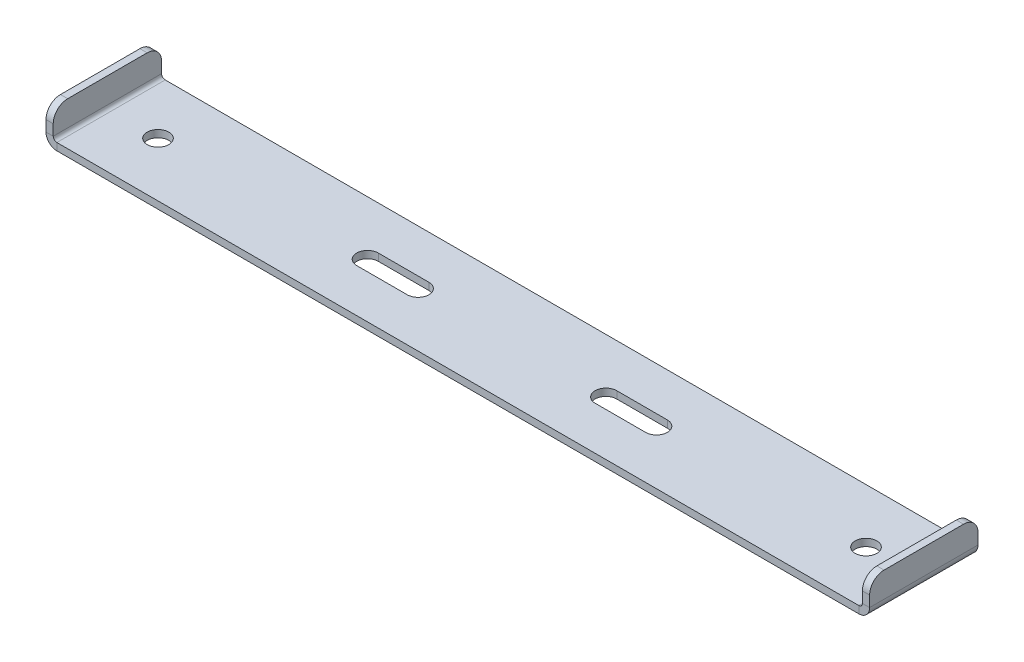
ISO-10303-21;
HEADER;
FILE_DESCRIPTION(('STEP AP214'),'2;1');
FILE_NAME('part.step','',(''),(''),'','','');
FILE_SCHEMA(('AUTOMOTIVE_DESIGN { 1 0 10303 214 1 1 1 1 }'));
ENDSEC;
DATA;
#1=APPLICATION_CONTEXT('core data for automotive mechanical design processes');
#2=APPLICATION_PROTOCOL_DEFINITION('international standard','automotive_design',2000,#1);
#3=PRODUCT_CONTEXT('',#1,'mechanical');
#4=PRODUCT('Part','Part','',(#3));
#5=PRODUCT_RELATED_PRODUCT_CATEGORY('part','',(#4));
#6=PRODUCT_DEFINITION_FORMATION('','',#4);
#7=PRODUCT_DEFINITION_CONTEXT('part definition',#1,'design');
#8=PRODUCT_DEFINITION('design','',#6,#7);
#9=PRODUCT_DEFINITION_SHAPE('','',#8);
#10=(LENGTH_UNIT() NAMED_UNIT(*) SI_UNIT(.MILLI.,.METRE.));
#11=(NAMED_UNIT(*) PLANE_ANGLE_UNIT() SI_UNIT($,.RADIAN.));
#12=(NAMED_UNIT(*) SI_UNIT($,.STERADIAN.) SOLID_ANGLE_UNIT());
#13=UNCERTAINTY_MEASURE_WITH_UNIT(LENGTH_MEASURE(1.E-05),#10,'distance_accuracy_value','');
#14=(GEOMETRIC_REPRESENTATION_CONTEXT(3) GLOBAL_UNCERTAINTY_ASSIGNED_CONTEXT((#13)) GLOBAL_UNIT_ASSIGNED_CONTEXT((#10,
#11,#12)) REPRESENTATION_CONTEXT('',''));
#15=CARTESIAN_POINT('',(0.,0.,0.));
#16=DIRECTION('',(0.,0.,1.));
#17=DIRECTION('',(1.,0.,0.));
#18=AXIS2_PLACEMENT_3D('',#15,#16,#17);
#19=CARTESIAN_POINT('',(0.,1.,0.));
#20=DIRECTION('',(0.,1.,0.));
#21=DIRECTION('',(0.,0.,1.));
#22=AXIS2_PLACEMENT_3D('',#19,#20,#21);
#23=PLANE('',#22);
#24=CARTESIAN_POINT('',(49.,1.,0.));
#25=DIRECTION('',(0.,1.,0.));
#26=DIRECTION('',(0.,0.,-1.));
#27=AXIS2_PLACEMENT_3D('',#24,#25,#26);
#28=CIRCLE('',#27,1.49999999999999);
#29=CARTESIAN_POINT('',(49.,1.,-1.5));
#30=VERTEX_POINT('',#29);
#31=EDGE_CURVE('E433',#30,#30,#28,.T.);
#32=ORIENTED_EDGE('',*,*,#31,.F.);
#33=EDGE_LOOP('',(#32));
#34=FACE_BOUND('',#33,.T.);
#35=CARTESIAN_POINT('',(-49.,1.,0.));
#36=DIRECTION('',(0.,1.,0.));
#37=DIRECTION('',(0.,0.,1.));
#38=AXIS2_PLACEMENT_3D('',#35,#36,#37);
#39=CIRCLE('',#38,1.5);
#40=CARTESIAN_POINT('',(-49.,1.,1.49999999999999));
#41=VERTEX_POINT('',#40);
#42=EDGE_CURVE('E273',#41,#41,#39,.T.);
#43=ORIENTED_EDGE('',*,*,#42,.F.);
#44=EDGE_LOOP('',(#43));
#45=FACE_BOUND('',#44,.T.);
#46=CARTESIAN_POINT('',(20.,1.,0.));
#47=DIRECTION('',(0.,1.,0.));
#48=DIRECTION('',(0.,0.,-1.));
#49=AXIS2_PLACEMENT_3D('',#46,#47,#48);
#50=CIRCLE('',#49,1.5);
#51=CARTESIAN_POINT('',(20.,1.,1.5));
#52=VERTEX_POINT('',#51);
#53=CARTESIAN_POINT('',(20.,1.,-1.5));
#54=VERTEX_POINT('',#53);
#55=EDGE_CURVE('E249',#52,#54,#50,.T.);
#56=ORIENTED_EDGE('',*,*,#55,.F.);
#57=DIRECTION('',(1.,0.,0.));
#58=VECTOR('',#57,1.);
#59=CARTESIAN_POINT('',(20.,1.,1.5));
#60=LINE('',#59,#58);
#61=CARTESIAN_POINT('',(13.,1.,1.5));
#62=VERTEX_POINT('',#61);
#63=EDGE_CURVE('E267',#62,#52,#60,.T.);
#64=ORIENTED_EDGE('',*,*,#63,.F.);
#65=CARTESIAN_POINT('',(13.,1.,0.));
#66=DIRECTION('',(0.,1.,0.));
#67=DIRECTION('',(0.,0.,-1.));
#68=AXIS2_PLACEMENT_3D('',#65,#66,#67);
#69=CIRCLE('',#68,1.5);
#70=CARTESIAN_POINT('',(13.,1.,-1.5));
#71=VERTEX_POINT('',#70);
#72=EDGE_CURVE('E270',#71,#62,#69,.T.);
#73=ORIENTED_EDGE('',*,*,#72,.F.);
#74=DIRECTION('',(-1.,0.,0.));
#75=VECTOR('',#74,1.);
#76=CARTESIAN_POINT('',(20.,1.,-1.5));
#77=LINE('',#76,#75);
#78=EDGE_CURVE('E279',#54,#71,#77,.T.);
#79=ORIENTED_EDGE('',*,*,#78,.F.);
#80=EDGE_LOOP('',(#56,#64,#73,#79));
#81=FACE_BOUND('',#80,.T.);
#82=CARTESIAN_POINT('',(-20.,1.,0.));
#83=DIRECTION('',(0.,1.,0.));
#84=DIRECTION('',(0.,0.,1.));
#85=AXIS2_PLACEMENT_3D('',#82,#83,#84);
#86=CIRCLE('',#85,1.5);
#87=CARTESIAN_POINT('',(-20.,1.,-1.5));
#88=VERTEX_POINT('',#87);
#89=CARTESIAN_POINT('',(-20.,1.,1.5));
#90=VERTEX_POINT('',#89);
#91=EDGE_CURVE('E286',#88,#90,#86,.T.);
#92=ORIENTED_EDGE('',*,*,#91,.F.);
#93=DIRECTION('',(-1.,0.,0.));
#94=VECTOR('',#93,1.);
#95=CARTESIAN_POINT('',(-20.,1.,-1.5));
#96=LINE('',#95,#94);
#97=CARTESIAN_POINT('',(-13.,1.,-1.5));
#98=VERTEX_POINT('',#97);
#99=EDGE_CURVE('E294',#98,#88,#96,.T.);
#100=ORIENTED_EDGE('',*,*,#99,.F.);
#101=CARTESIAN_POINT('',(-13.,1.,0.));
#102=DIRECTION('',(0.,1.,0.));
#103=DIRECTION('',(0.,0.,1.));
#104=AXIS2_PLACEMENT_3D('',#101,#102,#103);
#105=CIRCLE('',#104,1.5);
#106=CARTESIAN_POINT('',(-13.,1.,1.5));
#107=VERTEX_POINT('',#106);
#108=EDGE_CURVE('E308',#107,#98,#105,.T.);
#109=ORIENTED_EDGE('',*,*,#108,.F.);
#110=DIRECTION('',(1.,0.,0.));
#111=VECTOR('',#110,1.);
#112=CARTESIAN_POINT('',(-20.,1.,1.5));
#113=LINE('',#112,#111);
#114=EDGE_CURVE('E305',#90,#107,#113,.T.);
#115=ORIENTED_EDGE('',*,*,#114,.F.);
#116=EDGE_LOOP('',(#92,#100,#109,#115));
#117=FACE_BOUND('',#116,.T.);
#118=DIRECTION('',(-1.,0.,0.));
#119=VECTOR('',#118,1.);
#120=CARTESIAN_POINT('',(-57.,1.,-7.5));
#121=LINE('',#120,#119);
#122=CARTESIAN_POINT('',(55.5,1.,-7.5));
#123=VERTEX_POINT('',#122);
#124=CARTESIAN_POINT('',(-55.5,1.,-7.5));
#125=VERTEX_POINT('',#124);
#126=EDGE_CURVE('E418',#123,#125,#121,.T.);
#127=ORIENTED_EDGE('',*,*,#126,.T.);
#128=DIRECTION('',(0.,0.,1.));
#129=VECTOR('',#128,1.);
#130=CARTESIAN_POINT('',(-55.5,1.,7.5));
#131=LINE('',#130,#129);
#132=CARTESIAN_POINT('',(-55.5,1.,7.5));
#133=VERTEX_POINT('',#132);
#134=EDGE_CURVE('E357',#133,#125,#131,.F.);
#135=ORIENTED_EDGE('',*,*,#134,.F.);
#136=DIRECTION('',(1.,0.,0.));
#137=VECTOR('',#136,1.);
#138=CARTESIAN_POINT('',(-57.,1.,7.5));
#139=LINE('',#138,#137);
#140=CARTESIAN_POINT('',(55.5,1.,7.5));
#141=VERTEX_POINT('',#140);
#142=EDGE_CURVE('E421',#133,#141,#139,.T.);
#143=ORIENTED_EDGE('',*,*,#142,.T.);
#144=DIRECTION('',(0.,0.,-1.));
#145=VECTOR('',#144,1.);
#146=CARTESIAN_POINT('',(55.5,1.,-7.5));
#147=LINE('',#146,#145);
#148=EDGE_CURVE('E408',#123,#141,#147,.F.);
#149=ORIENTED_EDGE('',*,*,#148,.F.);
#150=EDGE_LOOP('',(#127,#135,#143,#149));
#151=FACE_BOUND('',#150,.T.);
#152=ADVANCED_FACE('F79',(#34,#45,#81,#117,#151),#23,.T.);
#153=CARTESIAN_POINT('',(0.,0.,0.));
#154=DIRECTION('',(0.,1.,0.));
#155=DIRECTION('',(0.,0.,1.));
#156=AXIS2_PLACEMENT_3D('',#153,#154,#155);
#157=PLANE('',#156);
#158=CARTESIAN_POINT('',(49.,0.,0.));
#159=DIRECTION('',(0.,1.,0.));
#160=DIRECTION('',(0.,0.,1.));
#161=AXIS2_PLACEMENT_3D('',#158,#159,#160);
#162=CIRCLE('',#161,1.49999999999999);
#163=CARTESIAN_POINT('',(49.,0.,1.49999999999998));
#164=VERTEX_POINT('',#163);
#165=EDGE_CURVE('E430',#164,#164,#162,.T.);
#166=ORIENTED_EDGE('',*,*,#165,.T.);
#167=EDGE_LOOP('',(#166));
#168=FACE_BOUND('',#167,.T.);
#169=CARTESIAN_POINT('',(-49.,0.,0.));
#170=DIRECTION('',(0.,1.,0.));
#171=DIRECTION('',(0.,0.,1.));
#172=AXIS2_PLACEMENT_3D('',#169,#170,#171);
#173=CIRCLE('',#172,1.5);
#174=CARTESIAN_POINT('',(-49.,0.,1.49999999999999));
#175=VERTEX_POINT('',#174);
#176=EDGE_CURVE('E280',#175,#175,#173,.T.);
#177=ORIENTED_EDGE('',*,*,#176,.T.);
#178=EDGE_LOOP('',(#177));
#179=FACE_BOUND('',#178,.T.);
#180=DIRECTION('',(1.,0.,0.));
#181=VECTOR('',#180,1.);
#182=CARTESIAN_POINT('',(20.,0.,1.5));
#183=LINE('',#182,#181);
#184=CARTESIAN_POINT('',(13.,0.,1.5));
#185=VERTEX_POINT('',#184);
#186=CARTESIAN_POINT('',(20.,0.,1.5));
#187=VERTEX_POINT('',#186);
#188=EDGE_CURVE('E254',#185,#187,#183,.T.);
#189=ORIENTED_EDGE('',*,*,#188,.T.);
#190=CARTESIAN_POINT('',(20.,0.,0.));
#191=DIRECTION('',(0.,1.,0.));
#192=DIRECTION('',(0.,0.,-1.));
#193=AXIS2_PLACEMENT_3D('',#190,#191,#192);
#194=CIRCLE('',#193,1.5);
#195=CARTESIAN_POINT('',(20.,0.,-1.5));
#196=VERTEX_POINT('',#195);
#197=EDGE_CURVE('E246',#187,#196,#194,.T.);
#198=ORIENTED_EDGE('',*,*,#197,.T.);
#199=DIRECTION('',(-1.,0.,0.));
#200=VECTOR('',#199,1.);
#201=CARTESIAN_POINT('',(20.,0.,-1.5));
#202=LINE('',#201,#200);
#203=CARTESIAN_POINT('',(13.,0.,-1.5));
#204=VERTEX_POINT('',#203);
#205=EDGE_CURVE('E258',#196,#204,#202,.T.);
#206=ORIENTED_EDGE('',*,*,#205,.T.);
#207=CARTESIAN_POINT('',(13.,0.,0.));
#208=DIRECTION('',(0.,1.,0.));
#209=DIRECTION('',(0.,0.,-1.));
#210=AXIS2_PLACEMENT_3D('',#207,#208,#209);
#211=CIRCLE('',#210,1.5);
#212=EDGE_CURVE('E262',#204,#185,#211,.T.);
#213=ORIENTED_EDGE('',*,*,#212,.T.);
#214=EDGE_LOOP('',(#189,#198,#206,#213));
#215=FACE_BOUND('',#214,.T.);
#216=DIRECTION('',(-1.,0.,0.));
#217=VECTOR('',#216,1.);
#218=CARTESIAN_POINT('',(-20.,0.,-1.5));
#219=LINE('',#218,#217);
#220=CARTESIAN_POINT('',(-13.,0.,-1.5));
#221=VERTEX_POINT('',#220);
#222=CARTESIAN_POINT('',(-20.,0.,-1.5));
#223=VERTEX_POINT('',#222);
#224=EDGE_CURVE('E300',#221,#223,#219,.T.);
#225=ORIENTED_EDGE('',*,*,#224,.T.);
#226=CARTESIAN_POINT('',(-20.,0.,0.));
#227=DIRECTION('',(0.,1.,0.));
#228=DIRECTION('',(0.,0.,1.));
#229=AXIS2_PLACEMENT_3D('',#226,#227,#228);
#230=CIRCLE('',#229,1.5);
#231=CARTESIAN_POINT('',(-20.,0.,1.5));
#232=VERTEX_POINT('',#231);
#233=EDGE_CURVE('E290',#223,#232,#230,.T.);
#234=ORIENTED_EDGE('',*,*,#233,.T.);
#235=DIRECTION('',(1.,0.,0.));
#236=VECTOR('',#235,1.);
#237=CARTESIAN_POINT('',(-20.,0.,1.5));
#238=LINE('',#237,#236);
#239=CARTESIAN_POINT('',(-13.,0.,1.5));
#240=VERTEX_POINT('',#239);
#241=EDGE_CURVE('E293',#232,#240,#238,.T.);
#242=ORIENTED_EDGE('',*,*,#241,.T.);
#243=CARTESIAN_POINT('',(-13.,0.,0.));
#244=DIRECTION('',(0.,1.,0.));
#245=DIRECTION('',(0.,0.,1.));
#246=AXIS2_PLACEMENT_3D('',#243,#244,#245);
#247=CIRCLE('',#246,1.5);
#248=EDGE_CURVE('E297',#240,#221,#247,.T.);
#249=ORIENTED_EDGE('',*,*,#248,.T.);
#250=EDGE_LOOP('',(#225,#234,#242,#249));
#251=FACE_BOUND('',#250,.T.);
#252=DIRECTION('',(0.,0.,1.));
#253=VECTOR('',#252,1.);
#254=CARTESIAN_POINT('',(-55.5,0.,7.5));
#255=LINE('',#254,#253);
#256=CARTESIAN_POINT('',(-55.5,0.,7.5));
#257=VERTEX_POINT('',#256);
#258=CARTESIAN_POINT('',(-55.5,0.,-7.5));
#259=VERTEX_POINT('',#258);
#260=EDGE_CURVE('E345',#257,#259,#255,.F.);
#261=ORIENTED_EDGE('',*,*,#260,.T.);
#262=DIRECTION('',(1.,0.,0.));
#263=VECTOR('',#262,1.);
#264=CARTESIAN_POINT('',(0.,0.,-7.5));
#265=LINE('',#264,#263);
#266=CARTESIAN_POINT('',(55.5,0.,-7.5));
#267=VERTEX_POINT('',#266);
#268=EDGE_CURVE('E416',#267,#259,#265,.F.);
#269=ORIENTED_EDGE('',*,*,#268,.F.);
#270=DIRECTION('',(0.,0.,-1.));
#271=VECTOR('',#270,1.);
#272=CARTESIAN_POINT('',(55.5,0.,-7.5));
#273=LINE('',#272,#271);
#274=CARTESIAN_POINT('',(55.5,0.,7.5));
#275=VERTEX_POINT('',#274);
#276=EDGE_CURVE('E395',#267,#275,#273,.F.);
#277=ORIENTED_EDGE('',*,*,#276,.T.);
#278=DIRECTION('',(1.,0.,0.));
#279=VECTOR('',#278,1.);
#280=CARTESIAN_POINT('',(0.,0.,7.5));
#281=LINE('',#280,#279);
#282=EDGE_CURVE('E422',#257,#275,#281,.T.);
#283=ORIENTED_EDGE('',*,*,#282,.F.);
#284=EDGE_LOOP('',(#261,#269,#277,#283));
#285=FACE_BOUND('',#284,.T.);
#286=ADVANCED_FACE('F264',(#168,#179,#215,#251,#285),#157,.F.);
#287=CARTESIAN_POINT('',(-57.,1.,7.5));
#288=DIRECTION('',(0.,0.,1.));
#289=DIRECTION('',(1.,0.,0.));
#290=AXIS2_PLACEMENT_3D('',#287,#288,#289);
#291=PLANE('',#290);
#292=ORIENTED_EDGE('',*,*,#142,.F.);
#293=DIRECTION('',(0.,-1.,0.));
#294=VECTOR('',#293,1.);
#295=CARTESIAN_POINT('',(-55.5,1.,7.5));
#296=LINE('',#295,#294);
#297=EDGE_CURVE('E351',#133,#257,#296,.T.);
#298=ORIENTED_EDGE('',*,*,#297,.T.);
#299=ORIENTED_EDGE('',*,*,#282,.T.);
#300=DIRECTION('',(0.,-1.,0.));
#301=VECTOR('',#300,1.);
#302=CARTESIAN_POINT('',(55.5,1.,7.5));
#303=LINE('',#302,#301);
#304=EDGE_CURVE('E413',#141,#275,#303,.T.);
#305=ORIENTED_EDGE('',*,*,#304,.F.);
#306=EDGE_LOOP('',(#292,#298,#299,#305));
#307=FACE_BOUND('',#306,.T.);
#308=ADVANCED_FACE('F522',(#307),#291,.T.);
#309=CARTESIAN_POINT('',(-57.,1.,-7.5));
#310=DIRECTION('',(0.,0.,-1.));
#311=DIRECTION('',(-1.,0.,0.));
#312=AXIS2_PLACEMENT_3D('',#309,#310,#311);
#313=PLANE('',#312);
#314=DIRECTION('',(0.,-1.,0.));
#315=VECTOR('',#314,1.);
#316=CARTESIAN_POINT('',(-55.5,1.,-7.5));
#317=LINE('',#316,#315);
#318=EDGE_CURVE('E362',#125,#259,#317,.T.);
#319=ORIENTED_EDGE('',*,*,#318,.F.);
#320=ORIENTED_EDGE('',*,*,#126,.F.);
#321=DIRECTION('',(0.,-1.,0.));
#322=VECTOR('',#321,1.);
#323=CARTESIAN_POINT('',(55.5,1.,-7.5));
#324=LINE('',#323,#322);
#325=EDGE_CURVE('E402',#123,#267,#324,.T.);
#326=ORIENTED_EDGE('',*,*,#325,.T.);
#327=ORIENTED_EDGE('',*,*,#268,.T.);
#328=EDGE_LOOP('',(#319,#320,#326,#327));
#329=FACE_BOUND('',#328,.T.);
#330=ADVANCED_FACE('F499',(#329),#313,.T.);
#331=CARTESIAN_POINT('',(55.5,1.5,7.5));
#332=DIRECTION('',(0.,0.,1.));
#333=DIRECTION('',(1.,0.,0.));
#334=AXIS2_PLACEMENT_3D('',#331,#332,#333);
#335=PLANE('',#334);
#336=DIRECTION('',(-1.,0.,0.));
#337=VECTOR('',#336,1.);
#338=CARTESIAN_POINT('',(57.,1.5,7.5));
#339=LINE('',#338,#337);
#340=CARTESIAN_POINT('',(56.,1.5,7.5));
#341=VERTEX_POINT('',#340);
#342=CARTESIAN_POINT('',(57.,1.5,7.5));
#343=VERTEX_POINT('',#342);
#344=EDGE_CURVE('E365',#341,#343,#339,.F.);
#345=ORIENTED_EDGE('',*,*,#344,.F.);
#346=CARTESIAN_POINT('',(55.5,1.5,7.5));
#347=DIRECTION('',(0.,0.,-1.));
#348=DIRECTION('',(-1.,0.,0.));
#349=AXIS2_PLACEMENT_3D('',#346,#347,#348);
#350=CIRCLE('',#349,0.5);
#351=EDGE_CURVE('E405',#141,#341,#350,.F.);
#352=ORIENTED_EDGE('',*,*,#351,.F.);
#353=ORIENTED_EDGE('',*,*,#304,.T.);
#354=CARTESIAN_POINT('',(55.5,1.5,7.5));
#355=DIRECTION('',(0.,0.,-1.));
#356=DIRECTION('',(-1.,0.,0.));
#357=AXIS2_PLACEMENT_3D('',#354,#355,#356);
#358=CIRCLE('',#357,1.5);
#359=EDGE_CURVE('E398',#275,#343,#358,.F.);
#360=ORIENTED_EDGE('',*,*,#359,.T.);
#361=EDGE_LOOP('',(#345,#352,#353,#360));
#362=FACE_BOUND('',#361,.T.);
#363=ADVANCED_FACE('F536',(#362),#335,.T.);
#364=CARTESIAN_POINT('',(55.5,1.5,-7.5));
#365=DIRECTION('',(0.,0.,1.));
#366=DIRECTION('',(1.,0.,0.));
#367=AXIS2_PLACEMENT_3D('',#364,#365,#366);
#368=PLANE('',#367);
#369=CARTESIAN_POINT('',(55.5,1.5,-7.5));
#370=DIRECTION('',(0.,0.,-1.));
#371=DIRECTION('',(-1.,0.,0.));
#372=AXIS2_PLACEMENT_3D('',#369,#370,#371);
#373=CIRCLE('',#372,0.5);
#374=CARTESIAN_POINT('',(56.,1.5,-7.5));
#375=VERTEX_POINT('',#374);
#376=EDGE_CURVE('E370',#375,#123,#373,.T.);
#377=ORIENTED_EDGE('',*,*,#376,.F.);
#378=DIRECTION('',(-1.,0.,0.));
#379=VECTOR('',#378,1.);
#380=CARTESIAN_POINT('',(56.,1.5,-7.5));
#381=LINE('',#380,#379);
#382=CARTESIAN_POINT('',(57.,1.5,-7.5));
#383=VERTEX_POINT('',#382);
#384=EDGE_CURVE('E388',#375,#383,#381,.F.);
#385=ORIENTED_EDGE('',*,*,#384,.T.);
#386=CARTESIAN_POINT('',(55.5,1.5,-7.5));
#387=DIRECTION('',(0.,0.,-1.));
#388=DIRECTION('',(-1.,0.,0.));
#389=AXIS2_PLACEMENT_3D('',#386,#387,#388);
#390=CIRCLE('',#389,1.5);
#391=EDGE_CURVE('E399',#383,#267,#390,.T.);
#392=ORIENTED_EDGE('',*,*,#391,.T.);
#393=ORIENTED_EDGE('',*,*,#325,.F.);
#394=EDGE_LOOP('',(#377,#385,#392,#393));
#395=FACE_BOUND('',#394,.T.);
#396=ADVANCED_FACE('F528',(#395),#368,.F.);
#397=CARTESIAN_POINT('',(55.5,1.5,-7.5));
#398=DIRECTION('',(0.,0.,-1.));
#399=DIRECTION('',(1.,0.,0.));
#400=AXIS2_PLACEMENT_3D('',#397,#398,#399);
#401=CYLINDRICAL_SURFACE('',#400,1.5);
#402=ORIENTED_EDGE('',*,*,#276,.F.);
#403=ORIENTED_EDGE('',*,*,#391,.F.);
#404=DIRECTION('',(0.,0.,-1.));
#405=VECTOR('',#404,1.);
#406=CARTESIAN_POINT('',(57.,1.5,7.5));
#407=LINE('',#406,#405);
#408=EDGE_CURVE('E385',#383,#343,#407,.F.);
#409=ORIENTED_EDGE('',*,*,#408,.T.);
#410=ORIENTED_EDGE('',*,*,#359,.F.);
#411=EDGE_LOOP('',(#402,#403,#409,#410));
#412=FACE_BOUND('',#411,.T.);
#413=ADVANCED_FACE('F792',(#412),#401,.T.);
#414=CARTESIAN_POINT('',(55.5,1.5,-7.5));
#415=DIRECTION('',(0.,0.,-1.));
#416=DIRECTION('',(1.,0.,0.));
#417=AXIS2_PLACEMENT_3D('',#414,#415,#416);
#418=CYLINDRICAL_SURFACE('',#417,0.5);
#419=ORIENTED_EDGE('',*,*,#148,.T.);
#420=ORIENTED_EDGE('',*,*,#351,.T.);
#421=DIRECTION('',(0.,0.,-1.));
#422=VECTOR('',#421,1.);
#423=CARTESIAN_POINT('',(56.,1.5,7.5));
#424=LINE('',#423,#422);
#425=EDGE_CURVE('E391',#341,#375,#424,.T.);
#426=ORIENTED_EDGE('',*,*,#425,.T.);
#427=ORIENTED_EDGE('',*,*,#376,.T.);
#428=EDGE_LOOP('',(#419,#420,#426,#427));
#429=FACE_BOUND('',#428,.T.);
#430=ADVANCED_FACE('F640',(#429),#418,.F.);
#431=CARTESIAN_POINT('',(57.,5.,-7.5));
#432=DIRECTION('',(0.,0.,1.));
#433=DIRECTION('',(1.,0.,0.));
#434=AXIS2_PLACEMENT_3D('',#431,#432,#433);
#435=PLANE('',#434);
#436=DIRECTION('',(0.,-1.,0.));
#437=VECTOR('',#436,1.);
#438=CARTESIAN_POINT('',(56.,5.,-7.5));
#439=LINE('',#438,#437);
#440=CARTESIAN_POINT('',(56.,3.,-7.5));
#441=VERTEX_POINT('',#440);
#442=EDGE_CURVE('E382',#375,#441,#439,.F.);
#443=ORIENTED_EDGE('',*,*,#442,.T.);
#444=DIRECTION('',(-1.,0.,0.));
#445=VECTOR('',#444,1.);
#446=CARTESIAN_POINT('',(57.,3.,-7.5));
#447=LINE('',#446,#445);
#448=CARTESIAN_POINT('',(57.,3.,-7.5));
#449=VERTEX_POINT('',#448);
#450=EDGE_CURVE('E442',#441,#449,#447,.F.);
#451=ORIENTED_EDGE('',*,*,#450,.T.);
#452=DIRECTION('',(0.,1.,0.));
#453=VECTOR('',#452,1.);
#454=CARTESIAN_POINT('',(57.,-2.01249957600199E-13,-7.5));
#455=LINE('',#454,#453);
#456=EDGE_CURVE('E374',#383,#449,#455,.T.);
#457=ORIENTED_EDGE('',*,*,#456,.F.);
#458=ORIENTED_EDGE('',*,*,#384,.F.);
#459=EDGE_LOOP('',(#443,#451,#457,#458));
#460=FACE_BOUND('',#459,.T.);
#461=ADVANCED_FACE('F632',(#460),#435,.F.);
#462=CARTESIAN_POINT('',(57.,0.999999999999997,7.5));
#463=DIRECTION('',(0.,0.,-1.));
#464=DIRECTION('',(-1.,0.,0.));
#465=AXIS2_PLACEMENT_3D('',#462,#463,#464);
#466=PLANE('',#465);
#467=DIRECTION('',(0.,-1.,0.));
#468=VECTOR('',#467,1.);
#469=CARTESIAN_POINT('',(57.,-2.01249957600199E-13,7.5));
#470=LINE('',#469,#468);
#471=CARTESIAN_POINT('',(57.,3.,7.5));
#472=VERTEX_POINT('',#471);
#473=EDGE_CURVE('E368',#472,#343,#470,.T.);
#474=ORIENTED_EDGE('',*,*,#473,.F.);
#475=DIRECTION('',(-1.,0.,0.));
#476=VECTOR('',#475,1.);
#477=CARTESIAN_POINT('',(57.,3.,7.5));
#478=LINE('',#477,#476);
#479=CARTESIAN_POINT('',(56.,3.,7.5));
#480=VERTEX_POINT('',#479);
#481=EDGE_CURVE('E448',#472,#480,#478,.T.);
#482=ORIENTED_EDGE('',*,*,#481,.T.);
#483=DIRECTION('',(0.,1.,0.));
#484=VECTOR('',#483,1.);
#485=CARTESIAN_POINT('',(56.,1.,7.5));
#486=LINE('',#485,#484);
#487=EDGE_CURVE('E377',#480,#341,#486,.F.);
#488=ORIENTED_EDGE('',*,*,#487,.T.);
#489=ORIENTED_EDGE('',*,*,#344,.T.);
#490=EDGE_LOOP('',(#474,#482,#488,#489));
#491=FACE_BOUND('',#490,.T.);
#492=ADVANCED_FACE('F624',(#491),#466,.F.);
#493=CARTESIAN_POINT('',(57.,-2.01249957600199E-13,0.));
#494=DIRECTION('',(-1.,0.,0.));
#495=DIRECTION('',(0.,-1.,0.));
#496=AXIS2_PLACEMENT_3D('',#493,#494,#495);
#497=PLANE('',#496);
#498=ORIENTED_EDGE('',*,*,#456,.T.);
#499=CARTESIAN_POINT('',(57.,3.,-5.5));
#500=DIRECTION('',(-1.,0.,0.));
#501=DIRECTION('',(0.,-1.,0.));
#502=AXIS2_PLACEMENT_3D('',#499,#500,#501);
#503=CIRCLE('',#502,2.);
#504=CARTESIAN_POINT('',(57.,5.,-5.5));
#505=VERTEX_POINT('',#504);
#506=EDGE_CURVE('E446',#449,#505,#503,.F.);
#507=ORIENTED_EDGE('',*,*,#506,.T.);
#508=DIRECTION('',(0.,0.,1.));
#509=VECTOR('',#508,1.);
#510=CARTESIAN_POINT('',(57.,5.,0.));
#511=LINE('',#510,#509);
#512=CARTESIAN_POINT('',(57.,5.,5.5));
#513=VERTEX_POINT('',#512);
#514=EDGE_CURVE('E371',#505,#513,#511,.T.);
#515=ORIENTED_EDGE('',*,*,#514,.T.);
#516=CARTESIAN_POINT('',(57.,3.,5.5));
#517=DIRECTION('',(-1.,0.,0.));
#518=DIRECTION('',(0.,-1.,0.));
#519=AXIS2_PLACEMENT_3D('',#516,#517,#518);
#520=CIRCLE('',#519,2.);
#521=EDGE_CURVE('E444',#513,#472,#520,.F.);
#522=ORIENTED_EDGE('',*,*,#521,.T.);
#523=ORIENTED_EDGE('',*,*,#473,.T.);
#524=ORIENTED_EDGE('',*,*,#408,.F.);
#525=EDGE_LOOP('',(#498,#507,#515,#522,#523,#524));
#526=FACE_BOUND('',#525,.T.);
#527=ADVANCED_FACE('F616',(#526),#497,.F.);
#528=CARTESIAN_POINT('',(56.,-1.97758476261356E-13,0.));
#529=DIRECTION('',(-1.,0.,0.));
#530=DIRECTION('',(0.,-1.,0.));
#531=AXIS2_PLACEMENT_3D('',#528,#529,#530);
#532=PLANE('',#531);
#533=DIRECTION('',(0.,0.,-1.));
#534=VECTOR('',#533,1.);
#535=CARTESIAN_POINT('',(56.,5.,7.5));
#536=LINE('',#535,#534);
#537=CARTESIAN_POINT('',(56.,5.,-5.5));
#538=VERTEX_POINT('',#537);
#539=CARTESIAN_POINT('',(56.,5.,5.5));
#540=VERTEX_POINT('',#539);
#541=EDGE_CURVE('E379',#538,#540,#536,.F.);
#542=ORIENTED_EDGE('',*,*,#541,.F.);
#543=CARTESIAN_POINT('',(56.,3.,-5.5));
#544=DIRECTION('',(-1.,0.,0.));
#545=DIRECTION('',(0.,-1.,0.));
#546=AXIS2_PLACEMENT_3D('',#543,#544,#545);
#547=CIRCLE('',#546,2.);
#548=EDGE_CURVE('E440',#538,#441,#547,.T.);
#549=ORIENTED_EDGE('',*,*,#548,.T.);
#550=ORIENTED_EDGE('',*,*,#442,.F.);
#551=ORIENTED_EDGE('',*,*,#425,.F.);
#552=ORIENTED_EDGE('',*,*,#487,.F.);
#553=CARTESIAN_POINT('',(56.,3.,5.5));
#554=DIRECTION('',(-1.,0.,0.));
#555=DIRECTION('',(0.,-1.,0.));
#556=AXIS2_PLACEMENT_3D('',#553,#554,#555);
#557=CIRCLE('',#556,2.);
#558=EDGE_CURVE('E438',#480,#540,#557,.T.);
#559=ORIENTED_EDGE('',*,*,#558,.T.);
#560=EDGE_LOOP('',(#542,#549,#550,#551,#552,#559));
#561=FACE_BOUND('',#560,.T.);
#562=ADVANCED_FACE('F607',(#561),#532,.T.);
#563=CARTESIAN_POINT('',(57.,5.,7.5));
#564=DIRECTION('',(0.,-1.,0.));
#565=DIRECTION('',(1.,0.,0.));
#566=AXIS2_PLACEMENT_3D('',#563,#564,#565);
#567=PLANE('',#566);
#568=ORIENTED_EDGE('',*,*,#514,.F.);
#569=DIRECTION('',(-1.,0.,0.));
#570=VECTOR('',#569,1.);
#571=CARTESIAN_POINT('',(57.,5.,-5.5));
#572=LINE('',#571,#570);
#573=EDGE_CURVE('E435',#505,#538,#572,.T.);
#574=ORIENTED_EDGE('',*,*,#573,.T.);
#575=ORIENTED_EDGE('',*,*,#541,.T.);
#576=DIRECTION('',(-1.,0.,0.));
#577=VECTOR('',#576,1.);
#578=CARTESIAN_POINT('',(57.,5.,5.5));
#579=LINE('',#578,#577);
#580=EDGE_CURVE('E424',#540,#513,#579,.F.);
#581=ORIENTED_EDGE('',*,*,#580,.T.);
#582=EDGE_LOOP('',(#568,#574,#575,#581));
#583=FACE_BOUND('',#582,.T.);
#584=ADVANCED_FACE('F603',(#583),#567,.F.);
#585=CARTESIAN_POINT('',(-55.5,1.5,-7.5));
#586=DIRECTION('',(0.,0.,-1.));
#587=DIRECTION('',(-1.,0.,0.));
#588=AXIS2_PLACEMENT_3D('',#585,#586,#587);
#589=PLANE('',#588);
#590=DIRECTION('',(1.,0.,0.));
#591=VECTOR('',#590,1.);
#592=CARTESIAN_POINT('',(-57.,1.5,-7.5));
#593=LINE('',#592,#591);
#594=CARTESIAN_POINT('',(-56.,1.5,-7.5));
#595=VERTEX_POINT('',#594);
#596=CARTESIAN_POINT('',(-57.,1.5,-7.5));
#597=VERTEX_POINT('',#596);
#598=EDGE_CURVE('E315',#595,#597,#593,.F.);
#599=ORIENTED_EDGE('',*,*,#598,.F.);
#600=CARTESIAN_POINT('',(-55.5,1.5,-7.5));
#601=DIRECTION('',(0.,0.,1.));
#602=DIRECTION('',(1.,0.,0.));
#603=AXIS2_PLACEMENT_3D('',#600,#601,#602);
#604=CIRCLE('',#603,0.5);
#605=EDGE_CURVE('E354',#125,#595,#604,.F.);
#606=ORIENTED_EDGE('',*,*,#605,.F.);
#607=ORIENTED_EDGE('',*,*,#318,.T.);
#608=CARTESIAN_POINT('',(-55.5,1.5,-7.5));
#609=DIRECTION('',(0.,0.,1.));
#610=DIRECTION('',(1.,0.,0.));
#611=AXIS2_PLACEMENT_3D('',#608,#609,#610);
#612=CIRCLE('',#611,1.5);
#613=EDGE_CURVE('E347',#259,#597,#612,.F.);
#614=ORIENTED_EDGE('',*,*,#613,.T.);
#615=EDGE_LOOP('',(#599,#606,#607,#614));
#616=FACE_BOUND('',#615,.T.);
#617=ADVANCED_FACE('F495',(#616),#589,.T.);
#618=CARTESIAN_POINT('',(-55.5,1.5,7.5));
#619=DIRECTION('',(0.,0.,-1.));
#620=DIRECTION('',(-1.,0.,0.));
#621=AXIS2_PLACEMENT_3D('',#618,#619,#620);
#622=PLANE('',#621);
#623=CARTESIAN_POINT('',(-55.5,1.5,7.5));
#624=DIRECTION('',(0.,0.,1.));
#625=DIRECTION('',(1.,0.,0.));
#626=AXIS2_PLACEMENT_3D('',#623,#624,#625);
#627=CIRCLE('',#626,0.5);
#628=CARTESIAN_POINT('',(-56.,1.5,7.5));
#629=VERTEX_POINT('',#628);
#630=EDGE_CURVE('E324',#629,#133,#627,.T.);
#631=ORIENTED_EDGE('',*,*,#630,.F.);
#632=DIRECTION('',(1.,0.,0.));
#633=VECTOR('',#632,1.);
#634=CARTESIAN_POINT('',(-56.,1.5,7.5));
#635=LINE('',#634,#633);
#636=CARTESIAN_POINT('',(-57.,1.5,7.5));
#637=VERTEX_POINT('',#636);
#638=EDGE_CURVE('E338',#629,#637,#635,.F.);
#639=ORIENTED_EDGE('',*,*,#638,.T.);
#640=CARTESIAN_POINT('',(-55.5,1.5,7.5));
#641=DIRECTION('',(0.,0.,1.));
#642=DIRECTION('',(1.,0.,0.));
#643=AXIS2_PLACEMENT_3D('',#640,#641,#642);
#644=CIRCLE('',#643,1.5);
#645=EDGE_CURVE('E348',#637,#257,#644,.T.);
#646=ORIENTED_EDGE('',*,*,#645,.T.);
#647=ORIENTED_EDGE('',*,*,#297,.F.);
#648=EDGE_LOOP('',(#631,#639,#646,#647));
#649=FACE_BOUND('',#648,.T.);
#650=ADVANCED_FACE('F488',(#649),#622,.F.);
#651=CARTESIAN_POINT('',(-55.5,1.5,7.5));
#652=DIRECTION('',(0.,0.,1.));
#653=DIRECTION('',(-1.,0.,0.));
#654=AXIS2_PLACEMENT_3D('',#651,#652,#653);
#655=CYLINDRICAL_SURFACE('',#654,1.5);
#656=ORIENTED_EDGE('',*,*,#260,.F.);
#657=ORIENTED_EDGE('',*,*,#645,.F.);
#658=DIRECTION('',(0.,0.,1.));
#659=VECTOR('',#658,1.);
#660=CARTESIAN_POINT('',(-57.,1.5,0.));
#661=LINE('',#660,#659);
#662=EDGE_CURVE('E335',#597,#637,#661,.T.);
#663=ORIENTED_EDGE('',*,*,#662,.F.);
#664=ORIENTED_EDGE('',*,*,#613,.F.);
#665=EDGE_LOOP('',(#656,#657,#663,#664));
#666=FACE_BOUND('',#665,.T.);
#667=ADVANCED_FACE('F493',(#666),#655,.T.);
#668=CARTESIAN_POINT('',(-55.5,1.5,7.5));
#669=DIRECTION('',(0.,0.,1.));
#670=DIRECTION('',(-1.,0.,0.));
#671=AXIS2_PLACEMENT_3D('',#668,#669,#670);
#672=CYLINDRICAL_SURFACE('',#671,0.5);
#673=ORIENTED_EDGE('',*,*,#134,.T.);
#674=ORIENTED_EDGE('',*,*,#605,.T.);
#675=DIRECTION('',(0.,0.,-1.));
#676=VECTOR('',#675,1.);
#677=CARTESIAN_POINT('',(-56.,1.5,-7.5));
#678=LINE('',#677,#676);
#679=EDGE_CURVE('E341',#595,#629,#678,.F.);
#680=ORIENTED_EDGE('',*,*,#679,.T.);
#681=ORIENTED_EDGE('',*,*,#630,.T.);
#682=EDGE_LOOP('',(#673,#674,#680,#681));
#683=FACE_BOUND('',#682,.T.);
#684=ADVANCED_FACE('F505',(#683),#672,.F.);
#685=CARTESIAN_POINT('',(-57.,0.999999999999997,7.5));
#686=DIRECTION('',(0.,0.,-1.));
#687=DIRECTION('',(-1.,0.,0.));
#688=AXIS2_PLACEMENT_3D('',#685,#686,#687);
#689=PLANE('',#688);
#690=DIRECTION('',(0.,1.,0.));
#691=VECTOR('',#690,1.);
#692=CARTESIAN_POINT('',(-56.,1.,7.5));
#693=LINE('',#692,#691);
#694=CARTESIAN_POINT('',(-56.,3.,7.5));
#695=VERTEX_POINT('',#694);
#696=EDGE_CURVE('E333',#629,#695,#693,.T.);
#697=ORIENTED_EDGE('',*,*,#696,.T.);
#698=DIRECTION('',(1.,0.,0.));
#699=VECTOR('',#698,1.);
#700=CARTESIAN_POINT('',(-57.,3.,7.5));
#701=LINE('',#700,#699);
#702=CARTESIAN_POINT('',(-57.,3.,7.5));
#703=VERTEX_POINT('',#702);
#704=EDGE_CURVE('E13',#695,#703,#701,.F.);
#705=ORIENTED_EDGE('',*,*,#704,.T.);
#706=DIRECTION('',(0.,-1.,0.));
#707=VECTOR('',#706,1.);
#708=CARTESIAN_POINT('',(-57.,-2.01249957600199E-13,7.5));
#709=LINE('',#708,#707);
#710=EDGE_CURVE('E327',#637,#703,#709,.F.);
#711=ORIENTED_EDGE('',*,*,#710,.F.);
#712=ORIENTED_EDGE('',*,*,#638,.F.);
#713=EDGE_LOOP('',(#697,#705,#711,#712));
#714=FACE_BOUND('',#713,.T.);
#715=ADVANCED_FACE('F485',(#714),#689,.F.);
#716=CARTESIAN_POINT('',(-57.,5.,-7.5));
#717=DIRECTION('',(0.,0.,1.));
#718=DIRECTION('',(1.,0.,0.));
#719=AXIS2_PLACEMENT_3D('',#716,#717,#718);
#720=PLANE('',#719);
#721=DIRECTION('',(0.,1.,0.));
#722=VECTOR('',#721,1.);
#723=CARTESIAN_POINT('',(-57.,-2.01249957600199E-13,-7.5));
#724=LINE('',#723,#722);
#725=CARTESIAN_POINT('',(-57.,3.,-7.5));
#726=VERTEX_POINT('',#725);
#727=EDGE_CURVE('E322',#726,#597,#724,.F.);
#728=ORIENTED_EDGE('',*,*,#727,.F.);
#729=DIRECTION('',(1.,0.,0.));
#730=VECTOR('',#729,1.);
#731=CARTESIAN_POINT('',(-57.,3.,-7.5));
#732=LINE('',#731,#730);
#733=CARTESIAN_POINT('',(-56.,3.,-7.5));
#734=VERTEX_POINT('',#733);
#735=EDGE_CURVE('E451',#726,#734,#732,.T.);
#736=ORIENTED_EDGE('',*,*,#735,.T.);
#737=DIRECTION('',(0.,-1.,0.));
#738=VECTOR('',#737,1.);
#739=CARTESIAN_POINT('',(-56.,5.,-7.5));
#740=LINE('',#739,#738);
#741=EDGE_CURVE('E329',#734,#595,#740,.T.);
#742=ORIENTED_EDGE('',*,*,#741,.T.);
#743=ORIENTED_EDGE('',*,*,#598,.T.);
#744=EDGE_LOOP('',(#728,#736,#742,#743));
#745=FACE_BOUND('',#744,.T.);
#746=ADVANCED_FACE('F471',(#745),#720,.F.);
#747=CARTESIAN_POINT('',(-57.,-2.01249957600199E-13,0.));
#748=DIRECTION('',(-1.,0.,0.));
#749=DIRECTION('',(0.,-1.,0.));
#750=AXIS2_PLACEMENT_3D('',#747,#748,#749);
#751=PLANE('',#750);
#752=DIRECTION('',(0.,0.,1.));
#753=VECTOR('',#752,1.);
#754=CARTESIAN_POINT('',(-57.,5.,0.));
#755=LINE('',#754,#753);
#756=CARTESIAN_POINT('',(-57.,5.,5.5));
#757=VERTEX_POINT('',#756);
#758=CARTESIAN_POINT('',(-57.,5.,-5.5));
#759=VERTEX_POINT('',#758);
#760=EDGE_CURVE('E325',#757,#759,#755,.F.);
#761=ORIENTED_EDGE('',*,*,#760,.T.);
#762=CARTESIAN_POINT('',(-57.,3.,-5.5));
#763=DIRECTION('',(-1.,0.,0.));
#764=DIRECTION('',(0.,-1.,0.));
#765=AXIS2_PLACEMENT_3D('',#762,#763,#764);
#766=CIRCLE('',#765,2.);
#767=EDGE_CURVE('E87',#759,#726,#766,.T.);
#768=ORIENTED_EDGE('',*,*,#767,.T.);
#769=ORIENTED_EDGE('',*,*,#727,.T.);
#770=ORIENTED_EDGE('',*,*,#662,.T.);
#771=ORIENTED_EDGE('',*,*,#710,.T.);
#772=CARTESIAN_POINT('',(-57.,3.,5.5));
#773=DIRECTION('',(-1.,0.,0.));
#774=DIRECTION('',(0.,-1.,0.));
#775=AXIS2_PLACEMENT_3D('',#772,#773,#774);
#776=CIRCLE('',#775,2.);
#777=EDGE_CURVE('E462',#703,#757,#776,.T.);
#778=ORIENTED_EDGE('',*,*,#777,.T.);
#779=EDGE_LOOP('',(#761,#768,#769,#770,#771,#778));
#780=FACE_BOUND('',#779,.T.);
#781=ADVANCED_FACE('F466',(#780),#751,.T.);
#782=CARTESIAN_POINT('',(-56.,-1.97758476261356E-13,0.));
#783=DIRECTION('',(-1.,0.,0.));
#784=DIRECTION('',(0.,-1.,0.));
#785=AXIS2_PLACEMENT_3D('',#782,#783,#784);
#786=PLANE('',#785);
#787=ORIENTED_EDGE('',*,*,#741,.F.);
#788=CARTESIAN_POINT('',(-56.,3.,-5.5));
#789=DIRECTION('',(-1.,0.,0.));
#790=DIRECTION('',(0.,-1.,0.));
#791=AXIS2_PLACEMENT_3D('',#788,#789,#790);
#792=CIRCLE('',#791,2.);
#793=CARTESIAN_POINT('',(-56.,5.,-5.5));
#794=VERTEX_POINT('',#793);
#795=EDGE_CURVE('E456',#734,#794,#792,.F.);
#796=ORIENTED_EDGE('',*,*,#795,.T.);
#797=DIRECTION('',(0.,0.,-1.));
#798=VECTOR('',#797,1.);
#799=CARTESIAN_POINT('',(-56.,5.,7.5));
#800=LINE('',#799,#798);
#801=CARTESIAN_POINT('',(-56.,5.,5.5));
#802=VERTEX_POINT('',#801);
#803=EDGE_CURVE('E331',#802,#794,#800,.T.);
#804=ORIENTED_EDGE('',*,*,#803,.F.);
#805=CARTESIAN_POINT('',(-56.,3.,5.5));
#806=DIRECTION('',(-1.,0.,0.));
#807=DIRECTION('',(0.,-1.,0.));
#808=AXIS2_PLACEMENT_3D('',#805,#806,#807);
#809=CIRCLE('',#808,2.);
#810=EDGE_CURVE('E454',#802,#695,#809,.F.);
#811=ORIENTED_EDGE('',*,*,#810,.T.);
#812=ORIENTED_EDGE('',*,*,#696,.F.);
#813=ORIENTED_EDGE('',*,*,#679,.F.);
#814=EDGE_LOOP('',(#787,#796,#804,#811,#812,#813));
#815=FACE_BOUND('',#814,.T.);
#816=ADVANCED_FACE('F477',(#815),#786,.F.);
#817=CARTESIAN_POINT('',(-57.,5.,7.5));
#818=DIRECTION('',(0.,-1.,0.));
#819=DIRECTION('',(1.,0.,0.));
#820=AXIS2_PLACEMENT_3D('',#817,#818,#819);
#821=PLANE('',#820);
#822=ORIENTED_EDGE('',*,*,#803,.T.);
#823=DIRECTION('',(1.,0.,0.));
#824=VECTOR('',#823,1.);
#825=CARTESIAN_POINT('',(-57.,5.,-5.5));
#826=LINE('',#825,#824);
#827=EDGE_CURVE('E100',#794,#759,#826,.F.);
#828=ORIENTED_EDGE('',*,*,#827,.T.);
#829=ORIENTED_EDGE('',*,*,#760,.F.);
#830=DIRECTION('',(1.,0.,0.));
#831=VECTOR('',#830,1.);
#832=CARTESIAN_POINT('',(-57.,5.,5.5));
#833=LINE('',#832,#831);
#834=EDGE_CURVE('E458',#757,#802,#833,.T.);
#835=ORIENTED_EDGE('',*,*,#834,.T.);
#836=EDGE_LOOP('',(#822,#828,#829,#835));
#837=FACE_BOUND('',#836,.T.);
#838=ADVANCED_FACE('F479',(#837),#821,.F.);
#839=CARTESIAN_POINT('',(-20.,0.,0.));
#840=DIRECTION('',(0.,1.,0.));
#841=DIRECTION('',(0.,0.,1.));
#842=AXIS2_PLACEMENT_3D('',#839,#840,#841);
#843=CYLINDRICAL_SURFACE('',#842,1.5);
#844=ORIENTED_EDGE('',*,*,#91,.T.);
#845=DIRECTION('',(0.,1.,0.));
#846=VECTOR('',#845,1.);
#847=CARTESIAN_POINT('',(-20.,0.,1.5));
#848=LINE('',#847,#846);
#849=EDGE_CURVE('E303',#232,#90,#848,.T.);
#850=ORIENTED_EDGE('',*,*,#849,.F.);
#851=ORIENTED_EDGE('',*,*,#233,.F.);
#852=DIRECTION('',(0.,1.,0.));
#853=VECTOR('',#852,1.);
#854=CARTESIAN_POINT('',(-20.,0.,-1.5));
#855=LINE('',#854,#853);
#856=EDGE_CURVE('E313',#223,#88,#855,.T.);
#857=ORIENTED_EDGE('',*,*,#856,.T.);
#858=EDGE_LOOP('',(#844,#850,#851,#857));
#859=FACE_BOUND('',#858,.T.);
#860=ADVANCED_FACE('F577',(#859),#843,.F.);
#861=CARTESIAN_POINT('',(-20.,0.,-1.5));
#862=DIRECTION('',(0.,0.,-1.));
#863=DIRECTION('',(-1.,0.,0.));
#864=AXIS2_PLACEMENT_3D('',#861,#862,#863);
#865=PLANE('',#864);
#866=ORIENTED_EDGE('',*,*,#99,.T.);
#867=ORIENTED_EDGE('',*,*,#856,.F.);
#868=ORIENTED_EDGE('',*,*,#224,.F.);
#869=DIRECTION('',(0.,1.,0.));
#870=VECTOR('',#869,1.);
#871=CARTESIAN_POINT('',(-13.,0.,-1.5));
#872=LINE('',#871,#870);
#873=EDGE_CURVE('E316',#221,#98,#872,.T.);
#874=ORIENTED_EDGE('',*,*,#873,.T.);
#875=EDGE_LOOP('',(#866,#867,#868,#874));
#876=FACE_BOUND('',#875,.T.);
#877=ADVANCED_FACE('F735',(#876),#865,.F.);
#878=CARTESIAN_POINT('',(-13.,0.,0.));
#879=DIRECTION('',(0.,1.,0.));
#880=DIRECTION('',(0.,0.,1.));
#881=AXIS2_PLACEMENT_3D('',#878,#879,#880);
#882=CYLINDRICAL_SURFACE('',#881,1.5);
#883=ORIENTED_EDGE('',*,*,#108,.T.);
#884=ORIENTED_EDGE('',*,*,#873,.F.);
#885=ORIENTED_EDGE('',*,*,#248,.F.);
#886=DIRECTION('',(0.,1.,0.));
#887=VECTOR('',#886,1.);
#888=CARTESIAN_POINT('',(-13.,0.,1.5));
#889=LINE('',#888,#887);
#890=EDGE_CURVE('E318',#240,#107,#889,.T.);
#891=ORIENTED_EDGE('',*,*,#890,.T.);
#892=EDGE_LOOP('',(#883,#884,#885,#891));
#893=FACE_BOUND('',#892,.T.);
#894=ADVANCED_FACE('F724',(#893),#882,.F.);
#895=CARTESIAN_POINT('',(-20.,0.,1.5));
#896=DIRECTION('',(0.,0.,1.));
#897=DIRECTION('',(1.,0.,0.));
#898=AXIS2_PLACEMENT_3D('',#895,#896,#897);
#899=PLANE('',#898);
#900=ORIENTED_EDGE('',*,*,#114,.T.);
#901=ORIENTED_EDGE('',*,*,#890,.F.);
#902=ORIENTED_EDGE('',*,*,#241,.F.);
#903=ORIENTED_EDGE('',*,*,#849,.T.);
#904=EDGE_LOOP('',(#900,#901,#902,#903));
#905=FACE_BOUND('',#904,.T.);
#906=ADVANCED_FACE('F714',(#905),#899,.F.);
#907=CARTESIAN_POINT('',(20.,0.,0.));
#908=DIRECTION('',(0.,1.,0.));
#909=DIRECTION('',(0.,0.,1.));
#910=AXIS2_PLACEMENT_3D('',#907,#908,#909);
#911=CYLINDRICAL_SURFACE('',#910,1.5);
#912=ORIENTED_EDGE('',*,*,#55,.T.);
#913=DIRECTION('',(0.,1.,0.));
#914=VECTOR('',#913,1.);
#915=CARTESIAN_POINT('',(20.,0.,-1.5));
#916=LINE('',#915,#914);
#917=EDGE_CURVE('E242',#196,#54,#916,.T.);
#918=ORIENTED_EDGE('',*,*,#917,.F.);
#919=ORIENTED_EDGE('',*,*,#197,.F.);
#920=DIRECTION('',(0.,1.,0.));
#921=VECTOR('',#920,1.);
#922=CARTESIAN_POINT('',(20.,0.,1.5));
#923=LINE('',#922,#921);
#924=EDGE_CURVE('E284',#187,#52,#923,.T.);
#925=ORIENTED_EDGE('',*,*,#924,.T.);
#926=EDGE_LOOP('',(#912,#918,#919,#925));
#927=FACE_BOUND('',#926,.T.);
#928=ADVANCED_FACE('F244',(#927),#911,.F.);
#929=CARTESIAN_POINT('',(20.,0.,1.5));
#930=DIRECTION('',(0.,0.,1.));
#931=DIRECTION('',(1.,0.,0.));
#932=AXIS2_PLACEMENT_3D('',#929,#930,#931);
#933=PLANE('',#932);
#934=ORIENTED_EDGE('',*,*,#63,.T.);
#935=ORIENTED_EDGE('',*,*,#924,.F.);
#936=ORIENTED_EDGE('',*,*,#188,.F.);
#937=DIRECTION('',(0.,1.,0.));
#938=VECTOR('',#937,1.);
#939=CARTESIAN_POINT('',(13.,0.,1.5));
#940=LINE('',#939,#938);
#941=EDGE_CURVE('E287',#185,#62,#940,.T.);
#942=ORIENTED_EDGE('',*,*,#941,.T.);
#943=EDGE_LOOP('',(#934,#935,#936,#942));
#944=FACE_BOUND('',#943,.T.);
#945=ADVANCED_FACE('F693',(#944),#933,.F.);
#946=CARTESIAN_POINT('',(13.,0.,0.));
#947=DIRECTION('',(0.,1.,0.));
#948=DIRECTION('',(0.,0.,1.));
#949=AXIS2_PLACEMENT_3D('',#946,#947,#948);
#950=CYLINDRICAL_SURFACE('',#949,1.5);
#951=ORIENTED_EDGE('',*,*,#72,.T.);
#952=ORIENTED_EDGE('',*,*,#941,.F.);
#953=ORIENTED_EDGE('',*,*,#212,.F.);
#954=DIRECTION('',(0.,1.,0.));
#955=VECTOR('',#954,1.);
#956=CARTESIAN_POINT('',(13.,0.,-1.5));
#957=LINE('',#956,#955);
#958=EDGE_CURVE('E253',#204,#71,#957,.T.);
#959=ORIENTED_EDGE('',*,*,#958,.T.);
#960=EDGE_LOOP('',(#951,#952,#953,#959));
#961=FACE_BOUND('',#960,.T.);
#962=ADVANCED_FACE('F683',(#961),#950,.F.);
#963=CARTESIAN_POINT('',(20.,0.,-1.5));
#964=DIRECTION('',(0.,0.,-1.));
#965=DIRECTION('',(-1.,0.,0.));
#966=AXIS2_PLACEMENT_3D('',#963,#964,#965);
#967=PLANE('',#966);
#968=ORIENTED_EDGE('',*,*,#78,.T.);
#969=ORIENTED_EDGE('',*,*,#958,.F.);
#970=ORIENTED_EDGE('',*,*,#205,.F.);
#971=ORIENTED_EDGE('',*,*,#917,.T.);
#972=EDGE_LOOP('',(#968,#969,#970,#971));
#973=FACE_BOUND('',#972,.T.);
#974=ADVANCED_FACE('F259',(#973),#967,.F.);
#975=CARTESIAN_POINT('',(-49.,-4.,0.));
#976=DIRECTION('',(0.,1.,0.));
#977=DIRECTION('',(0.,0.,1.));
#978=AXIS2_PLACEMENT_3D('',#975,#976,#977);
#979=CYLINDRICAL_SURFACE('',#978,1.5);
#980=ORIENTED_EDGE('',*,*,#42,.T.);
#981=EDGE_LOOP('',(#980));
#982=FACE_BOUND('',#981,.T.);
#983=ORIENTED_EDGE('',*,*,#176,.F.);
#984=EDGE_LOOP('',(#983));
#985=FACE_BOUND('',#984,.T.);
#986=ADVANCED_FACE('F648',(#982,#985),#979,.F.);
#987=CARTESIAN_POINT('',(49.,-4.,0.));
#988=DIRECTION('',(0.,1.,0.));
#989=DIRECTION('',(0.,0.,1.));
#990=AXIS2_PLACEMENT_3D('',#987,#988,#989);
#991=CYLINDRICAL_SURFACE('',#990,1.49999999999999);
#992=ORIENTED_EDGE('',*,*,#31,.T.);
#993=EDGE_LOOP('',(#992));
#994=FACE_BOUND('',#993,.T.);
#995=ORIENTED_EDGE('',*,*,#165,.F.);
#996=EDGE_LOOP('',(#995));
#997=FACE_BOUND('',#996,.T.);
#998=ADVANCED_FACE('F541',(#994,#997),#991,.F.);
#999=CARTESIAN_POINT('',(57.,3.,-5.5));
#1000=DIRECTION('',(-1.,0.,0.));
#1001=DIRECTION('',(0.,-1.,0.));
#1002=AXIS2_PLACEMENT_3D('',#999,#1000,#1001);
#1003=CYLINDRICAL_SURFACE('',#1002,2.);
#1004=ORIENTED_EDGE('',*,*,#506,.F.);
#1005=ORIENTED_EDGE('',*,*,#450,.F.);
#1006=ORIENTED_EDGE('',*,*,#548,.F.);
#1007=ORIENTED_EDGE('',*,*,#573,.F.);
#1008=EDGE_LOOP('',(#1004,#1005,#1006,#1007));
#1009=FACE_BOUND('',#1008,.T.);
#1010=ADVANCED_FACE('F537',(#1009),#1003,.T.);
#1011=CARTESIAN_POINT('',(57.,3.,5.5));
#1012=DIRECTION('',(-1.,0.,0.));
#1013=DIRECTION('',(0.,-1.,0.));
#1014=AXIS2_PLACEMENT_3D('',#1011,#1012,#1013);
#1015=CYLINDRICAL_SURFACE('',#1014,2.);
#1016=ORIENTED_EDGE('',*,*,#521,.F.);
#1017=ORIENTED_EDGE('',*,*,#580,.F.);
#1018=ORIENTED_EDGE('',*,*,#558,.F.);
#1019=ORIENTED_EDGE('',*,*,#481,.F.);
#1020=EDGE_LOOP('',(#1016,#1017,#1018,#1019));
#1021=FACE_BOUND('',#1020,.T.);
#1022=ADVANCED_FACE('F540',(#1021),#1015,.T.);
#1023=CARTESIAN_POINT('',(-57.,3.,-5.5));
#1024=DIRECTION('',(1.,0.,0.));
#1025=DIRECTION('',(0.,1.,0.));
#1026=AXIS2_PLACEMENT_3D('',#1023,#1024,#1025);
#1027=CYLINDRICAL_SURFACE('',#1026,2.);
#1028=ORIENTED_EDGE('',*,*,#767,.F.);
#1029=ORIENTED_EDGE('',*,*,#827,.F.);
#1030=ORIENTED_EDGE('',*,*,#795,.F.);
#1031=ORIENTED_EDGE('',*,*,#735,.F.);
#1032=EDGE_LOOP('',(#1028,#1029,#1030,#1031));
#1033=FACE_BOUND('',#1032,.T.);
#1034=ADVANCED_FACE('F474',(#1033),#1027,.T.);
#1035=CARTESIAN_POINT('',(-57.,3.,5.5));
#1036=DIRECTION('',(1.,0.,0.));
#1037=DIRECTION('',(0.,1.,0.));
#1038=AXIS2_PLACEMENT_3D('',#1035,#1036,#1037);
#1039=CYLINDRICAL_SURFACE('',#1038,2.);
#1040=ORIENTED_EDGE('',*,*,#777,.F.);
#1041=ORIENTED_EDGE('',*,*,#704,.F.);
#1042=ORIENTED_EDGE('',*,*,#810,.F.);
#1043=ORIENTED_EDGE('',*,*,#834,.F.);
#1044=EDGE_LOOP('',(#1040,#1041,#1042,#1043));
#1045=FACE_BOUND('',#1044,.T.);
#1046=ADVANCED_FACE('F81',(#1045),#1039,.T.);
#1047=CLOSED_SHELL('',(#152,#286,#308,#330,#363,#396,#413,#430,#461,#492,#527,#562,#584,#617,
#650,#667,#684,#715,#746,#781,#816,#838,#860,#877,#894,#906,#928,#945,#962,#974,#986,#998,#1010,
#1022,#1034,#1046));
#1048=MANIFOLD_SOLID_BREP('B2',#1047);
#1049=ADVANCED_BREP_SHAPE_REPRESENTATION('',(#18,#1048),#14);
#1050=SHAPE_DEFINITION_REPRESENTATION(#9,#1049);
ENDSEC;
END-ISO-10303-21;
